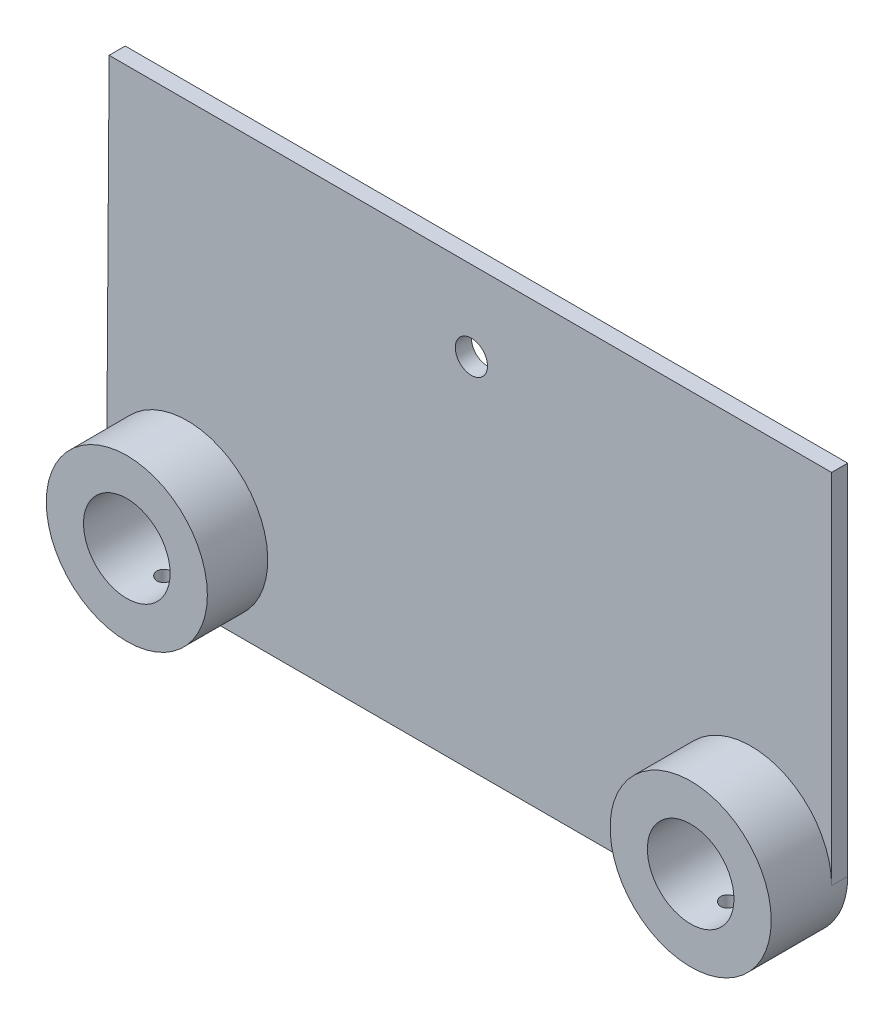
ISO-10303-21;
HEADER;
FILE_DESCRIPTION(('STEP AP214'),'2;1');
FILE_NAME('part.step','',(''),(''),'','','');
FILE_SCHEMA(('AUTOMOTIVE_DESIGN { 1 0 10303 214 1 1 1 1 }'));
ENDSEC;
DATA;
#1=APPLICATION_CONTEXT('core data for automotive mechanical design processes');
#2=APPLICATION_PROTOCOL_DEFINITION('international standard','automotive_design',2000,#1);
#3=PRODUCT_CONTEXT('',#1,'mechanical');
#4=PRODUCT('Part','Part','',(#3));
#5=PRODUCT_RELATED_PRODUCT_CATEGORY('part','',(#4));
#6=PRODUCT_DEFINITION_FORMATION('','',#4);
#7=PRODUCT_DEFINITION_CONTEXT('part definition',#1,'design');
#8=PRODUCT_DEFINITION('design','',#6,#7);
#9=PRODUCT_DEFINITION_SHAPE('','',#8);
#10=(LENGTH_UNIT() NAMED_UNIT(*) SI_UNIT(.MILLI.,.METRE.));
#11=(NAMED_UNIT(*) PLANE_ANGLE_UNIT() SI_UNIT($,.RADIAN.));
#12=(NAMED_UNIT(*) SI_UNIT($,.STERADIAN.) SOLID_ANGLE_UNIT());
#13=UNCERTAINTY_MEASURE_WITH_UNIT(LENGTH_MEASURE(1.E-05),#10,'distance_accuracy_value','');
#14=(GEOMETRIC_REPRESENTATION_CONTEXT(3) GLOBAL_UNCERTAINTY_ASSIGNED_CONTEXT((#13)) GLOBAL_UNIT_ASSIGNED_CONTEXT((#10,
#11,#12)) REPRESENTATION_CONTEXT('',''));
#15=CARTESIAN_POINT('',(0.,0.,0.));
#16=DIRECTION('',(0.,0.,1.));
#17=DIRECTION('',(1.,0.,0.));
#18=AXIS2_PLACEMENT_3D('',#15,#16,#17);
#19=CARTESIAN_POINT('',(70.,0.,4.));
#20=DIRECTION('',(0.,0.,1.));
#21=DIRECTION('',(1.,0.,0.));
#22=AXIS2_PLACEMENT_3D('',#19,#20,#21);
#23=PLANE('',#22);
#24=CARTESIAN_POINT('',(0.554740673181675,69.,4.));
#25=DIRECTION('',(0.,0.,1.));
#26=DIRECTION('',(1.,0.,0.));
#27=AXIS2_PLACEMENT_3D('',#24,#25,#26);
#28=CIRCLE('',#27,4.);
#29=CARTESIAN_POINT('',(4.55474067318168,69.,4.));
#30=VERTEX_POINT('',#29);
#31=EDGE_CURVE('E142',#30,#30,#28,.F.);
#32=ORIENTED_EDGE('',*,*,#31,.T.);
#33=EDGE_LOOP('',(#32));
#34=FACE_BOUND('',#33,.T.);
#35=DIRECTION('',(1.,0.,0.));
#36=VECTOR('',#35,1.);
#37=CARTESIAN_POINT('',(-70.,-20.,4.));
#38=LINE('',#37,#36);
#39=CARTESIAN_POINT('',(-70.,-20.,4.));
#40=VERTEX_POINT('',#39);
#41=CARTESIAN_POINT('',(70.,-20.,4.));
#42=VERTEX_POINT('',#41);
#43=EDGE_CURVE('E115',#40,#42,#38,.T.);
#44=ORIENTED_EDGE('',*,*,#43,.T.);
#45=CARTESIAN_POINT('',(70.,0.,4.));
#46=DIRECTION('',(0.,0.,1.));
#47=DIRECTION('',(1.,0.,0.));
#48=AXIS2_PLACEMENT_3D('',#45,#46,#47);
#49=CIRCLE('',#48,20.);
#50=CARTESIAN_POINT('',(90.,0.,4.));
#51=VERTEX_POINT('',#50);
#52=EDGE_CURVE('E103',#42,#51,#49,.F.);
#53=ORIENTED_EDGE('',*,*,#52,.T.);
#54=DIRECTION('',(0.,1.,0.));
#55=VECTOR('',#54,1.);
#56=CARTESIAN_POINT('',(90.,88.85,4.));
#57=LINE('',#56,#55);
#58=CARTESIAN_POINT('',(90.,88.85,4.));
#59=VERTEX_POINT('',#58);
#60=EDGE_CURVE('E64',#51,#59,#57,.T.);
#61=ORIENTED_EDGE('',*,*,#60,.T.);
#62=DIRECTION('',(-1.,0.,0.));
#63=VECTOR('',#62,1.);
#64=CARTESIAN_POINT('',(-89.3894864788953,88.85,4.));
#65=LINE('',#64,#63);
#66=CARTESIAN_POINT('',(-89.3894864788953,88.85,4.));
#67=VERTEX_POINT('',#66);
#68=EDGE_CURVE('E152',#59,#67,#65,.T.);
#69=ORIENTED_EDGE('',*,*,#68,.T.);
#70=DIRECTION('',(-0.00687112109239564,-0.999976393568835,0.));
#71=VECTOR('',#70,1.);
#72=CARTESIAN_POINT('',(-89.3894864788953,88.85,4.));
#73=LINE('',#72,#71);
#74=CARTESIAN_POINT('',(-89.9981115077974,0.274838355588614,4.));
#75=VERTEX_POINT('',#74);
#76=EDGE_CURVE('E94',#67,#75,#73,.T.);
#77=ORIENTED_EDGE('',*,*,#76,.T.);
#78=CARTESIAN_POINT('',(-70.,0.,4.));
#79=DIRECTION('',(0.,0.,1.));
#80=DIRECTION('',(1.,0.,0.));
#81=AXIS2_PLACEMENT_3D('',#78,#79,#80);
#82=CIRCLE('',#81,20.);
#83=EDGE_CURVE('E117',#75,#40,#82,.F.);
#84=ORIENTED_EDGE('',*,*,#83,.T.);
#85=EDGE_LOOP('',(#44,#53,#61,#69,#77,#84));
#86=FACE_BOUND('',#85,.T.);
#87=ADVANCED_FACE('F33',(#34,#86),#23,.T.);
#88=CARTESIAN_POINT('',(-89.3894864788953,88.85,4.));
#89=DIRECTION('',(0.999976393568835,-0.00687112109239564,0.));
#90=DIRECTION('',(0.00687112109239564,0.999976393568835,0.));
#91=AXIS2_PLACEMENT_3D('',#88,#89,#90);
#92=PLANE('',#91);
#93=DIRECTION('',(0.,0.,-1.));
#94=VECTOR('',#93,1.);
#95=CARTESIAN_POINT('',(-89.9981115077974,0.274838355588631,19.));
#96=LINE('',#95,#94);
#97=CARTESIAN_POINT('',(-89.9981115077974,0.274838355588631,0.));
#98=VERTEX_POINT('',#97);
#99=EDGE_CURVE('E55',#75,#98,#96,.T.);
#100=ORIENTED_EDGE('',*,*,#99,.F.);
#101=ORIENTED_EDGE('',*,*,#76,.F.);
#102=DIRECTION('',(0.,0.,-1.));
#103=VECTOR('',#102,1.);
#104=CARTESIAN_POINT('',(-89.3894864788953,88.85,4.));
#105=LINE('',#104,#103);
#106=CARTESIAN_POINT('',(-89.3894864788953,88.85,0.));
#107=VERTEX_POINT('',#106);
#108=EDGE_CURVE('E11',#67,#107,#105,.T.);
#109=ORIENTED_EDGE('',*,*,#108,.T.);
#110=DIRECTION('',(-0.00687112109239564,-0.999976393568835,0.));
#111=VECTOR('',#110,1.);
#112=CARTESIAN_POINT('',(-89.3894864788953,88.85,0.));
#113=LINE('',#112,#111);
#114=EDGE_CURVE('E158',#107,#98,#113,.T.);
#115=ORIENTED_EDGE('',*,*,#114,.T.);
#116=EDGE_LOOP('',(#100,#101,#109,#115));
#117=FACE_BOUND('',#116,.T.);
#118=ADVANCED_FACE('F173',(#117),#92,.F.);
#119=CARTESIAN_POINT('',(70.,0.,0.));
#120=DIRECTION('',(0.,0.,1.));
#121=DIRECTION('',(1.,0.,0.));
#122=AXIS2_PLACEMENT_3D('',#119,#120,#121);
#123=PLANE('',#122);
#124=CARTESIAN_POINT('',(70.,0.,0.));
#125=DIRECTION('',(0.,0.,1.));
#126=DIRECTION('',(1.,0.,0.));
#127=AXIS2_PLACEMENT_3D('',#124,#125,#126);
#128=CIRCLE('',#127,20.);
#129=CARTESIAN_POINT('',(70.,-20.,0.));
#130=VERTEX_POINT('',#129);
#131=CARTESIAN_POINT('',(90.,0.,0.));
#132=VERTEX_POINT('',#131);
#133=EDGE_CURVE('E160',#130,#132,#128,.T.);
#134=ORIENTED_EDGE('',*,*,#133,.F.);
#135=DIRECTION('',(1.,0.,0.));
#136=VECTOR('',#135,1.);
#137=CARTESIAN_POINT('',(-70.,-20.,0.));
#138=LINE('',#137,#136);
#139=CARTESIAN_POINT('',(-70.,-20.,0.));
#140=VERTEX_POINT('',#139);
#141=EDGE_CURVE('E124',#140,#130,#138,.T.);
#142=ORIENTED_EDGE('',*,*,#141,.F.);
#143=CARTESIAN_POINT('',(-70.,0.,0.));
#144=DIRECTION('',(0.,0.,1.));
#145=DIRECTION('',(1.,0.,0.));
#146=AXIS2_PLACEMENT_3D('',#143,#144,#145);
#147=CIRCLE('',#146,20.);
#148=CARTESIAN_POINT('',(-90.,0.,0.));
#149=VERTEX_POINT('',#148);
#150=EDGE_CURVE('E161',#149,#140,#147,.T.);
#151=ORIENTED_EDGE('',*,*,#150,.F.);
#152=CARTESIAN_POINT('',(-70.,0.,0.));
#153=DIRECTION('',(0.,0.,1.));
#154=DIRECTION('',(-0.999905575389868,0.0137419177794317,0.));
#155=AXIS2_PLACEMENT_3D('',#152,#153,#154);
#156=CIRCLE('',#155,20.);
#157=EDGE_CURVE('E171',#98,#149,#156,.T.);
#158=ORIENTED_EDGE('',*,*,#157,.F.);
#159=ORIENTED_EDGE('',*,*,#114,.F.);
#160=DIRECTION('',(-1.,0.,0.));
#161=VECTOR('',#160,1.);
#162=CARTESIAN_POINT('',(-89.3894864788953,88.85,0.));
#163=LINE('',#162,#161);
#164=CARTESIAN_POINT('',(90.,88.85,0.));
#165=VERTEX_POINT('',#164);
#166=EDGE_CURVE('E151',#165,#107,#163,.T.);
#167=ORIENTED_EDGE('',*,*,#166,.F.);
#168=DIRECTION('',(0.,1.,0.));
#169=VECTOR('',#168,1.);
#170=CARTESIAN_POINT('',(90.,88.85,0.));
#171=LINE('',#170,#169);
#172=EDGE_CURVE('E91',#132,#165,#171,.T.);
#173=ORIENTED_EDGE('',*,*,#172,.F.);
#174=EDGE_LOOP('',(#134,#142,#151,#158,#159,#167,#173));
#175=FACE_BOUND('',#174,.T.);
#176=CARTESIAN_POINT('',(70.,0.,0.));
#177=DIRECTION('',(0.,0.,1.));
#178=DIRECTION('',(1.,0.,0.));
#179=AXIS2_PLACEMENT_3D('',#176,#177,#178);
#180=CIRCLE('',#179,10.75);
#181=CARTESIAN_POINT('',(80.75,0.,0.));
#182=VERTEX_POINT('',#181);
#183=EDGE_CURVE('E148',#182,#182,#180,.T.);
#184=ORIENTED_EDGE('',*,*,#183,.T.);
#185=EDGE_LOOP('',(#184));
#186=FACE_BOUND('',#185,.T.);
#187=CARTESIAN_POINT('',(0.554740673181675,69.,0.));
#188=DIRECTION('',(0.,0.,1.));
#189=DIRECTION('',(1.,0.,0.));
#190=AXIS2_PLACEMENT_3D('',#187,#188,#189);
#191=CIRCLE('',#190,4.);
#192=CARTESIAN_POINT('',(4.55474067318168,69.,0.));
#193=VERTEX_POINT('',#192);
#194=EDGE_CURVE('E138',#193,#193,#191,.T.);
#195=ORIENTED_EDGE('',*,*,#194,.T.);
#196=EDGE_LOOP('',(#195));
#197=FACE_BOUND('',#196,.T.);
#198=CARTESIAN_POINT('',(-70.,0.,0.));
#199=DIRECTION('',(0.,0.,1.));
#200=DIRECTION('',(1.,0.,0.));
#201=AXIS2_PLACEMENT_3D('',#198,#199,#200);
#202=CIRCLE('',#201,10.75);
#203=CARTESIAN_POINT('',(-59.25,0.,0.));
#204=VERTEX_POINT('',#203);
#205=EDGE_CURVE('E145',#204,#204,#202,.T.);
#206=ORIENTED_EDGE('',*,*,#205,.T.);
#207=EDGE_LOOP('',(#206));
#208=FACE_BOUND('',#207,.T.);
#209=ADVANCED_FACE('F168',(#175,#186,#197,#208),#123,.F.);
#210=CARTESIAN_POINT('',(-89.3894864788953,88.85,4.));
#211=DIRECTION('',(0.,-1.,0.));
#212=DIRECTION('',(0.,0.,-1.));
#213=AXIS2_PLACEMENT_3D('',#210,#211,#212);
#214=PLANE('',#213);
#215=ORIENTED_EDGE('',*,*,#166,.T.);
#216=ORIENTED_EDGE('',*,*,#108,.F.);
#217=ORIENTED_EDGE('',*,*,#68,.F.);
#218=DIRECTION('',(0.,0.,-1.));
#219=VECTOR('',#218,1.);
#220=CARTESIAN_POINT('',(90.,88.85,4.));
#221=LINE('',#220,#219);
#222=EDGE_CURVE('E127',#59,#165,#221,.T.);
#223=ORIENTED_EDGE('',*,*,#222,.T.);
#224=EDGE_LOOP('',(#215,#216,#217,#223));
#225=FACE_BOUND('',#224,.T.);
#226=ADVANCED_FACE('F35',(#225),#214,.F.);
#227=CARTESIAN_POINT('',(-70.,0.,4.));
#228=DIRECTION('',(0.,0.,-1.));
#229=DIRECTION('',(-1.,0.,0.));
#230=AXIS2_PLACEMENT_3D('',#227,#228,#229);
#231=CYLINDRICAL_SURFACE('',#230,20.);
#232=CARTESIAN_POINT('',(-70.,-20.,11.5));
#233=CARTESIAN_POINT('',(-69.8879592924169,-19.9999987104154,11.4999951481992));
#234=CARTESIAN_POINT('',(-69.7758445096645,-19.9990485119241,11.4905534622071));
#235=CARTESIAN_POINT('',(-69.5547232030063,-19.9953493518948,11.4530312594191));
#236=CARTESIAN_POINT('',(-69.4457202416624,-19.9925984086805,11.4249302079508));
#237=CARTESIAN_POINT('',(-69.2340566490932,-19.9856082912614,11.3509155188043));
#238=CARTESIAN_POINT('',(-69.1313922307702,-19.9813700160142,11.305012638963));
#239=CARTESIAN_POINT('',(-68.9352476780792,-19.9718791478861,11.1967181841367));
#240=CARTESIAN_POINT('',(-68.8417657224418,-19.9666267567626,11.1343298879997));
#241=CARTESIAN_POINT('',(-68.6662808986518,-19.9556748868265,10.9945946046755));
#242=CARTESIAN_POINT('',(-68.5843157103302,-19.9499740314773,10.9172004011959));
#243=CARTESIAN_POINT('',(-68.434514957138,-19.9387791381253,10.7497509314739));
#244=CARTESIAN_POINT('',(-68.3666800458347,-19.9332851096983,10.6596950799152));
#245=CARTESIAN_POINT('',(-68.2469320591128,-19.9231118310557,10.4692429366328));
#246=CARTESIAN_POINT('',(-68.1950530690902,-19.9184343342181,10.3688251118103));
#247=CARTESIAN_POINT('',(-68.1089072305145,-19.9104407509305,10.16064882819));
#248=CARTESIAN_POINT('',(-68.0746399468174,-19.9071246308444,10.0528905508321));
#249=CARTESIAN_POINT('',(-68.0248019167962,-19.9022416814596,9.83347639826798));
#250=CARTESIAN_POINT('',(-68.0091686939924,-19.9006690079619,9.72183484629559));
#251=CARTESIAN_POINT('',(-67.9968494297293,-19.8994328612105,9.49750227320844));
#252=CARTESIAN_POINT('',(-68.0001628902584,-19.8997693377749,9.38481127975589));
#253=CARTESIAN_POINT('',(-68.0255914394946,-19.9023081379787,9.16200938061337));
#254=CARTESIAN_POINT('',(-68.0476383117509,-19.904503691813,9.05189060134262));
#255=CARTESIAN_POINT('',(-68.1098017116988,-19.9105026857484,8.83692407359782));
#256=CARTESIAN_POINT('',(-68.1499184834885,-19.9143061475698,8.73207639634994));
#257=CARTESIAN_POINT('',(-68.247158212237,-19.9231001890414,8.53041282540223));
#258=CARTESIAN_POINT('',(-68.30431143456,-19.9280928781632,8.43361162102138));
#259=CARTESIAN_POINT('',(-68.4339799452935,-19.9387010346576,8.25094957017624));
#260=CARTESIAN_POINT('',(-68.506495683327,-19.9443165202557,8.16508904403648));
#261=CARTESIAN_POINT('',(-68.6652117751759,-19.9555677062598,8.00634921202195));
#262=CARTESIAN_POINT('',(-68.7514710422973,-19.96120338666,7.9335287962384));
#263=CARTESIAN_POINT('',(-68.9350210365258,-19.9718365815704,7.80339273417923));
#264=CARTESIAN_POINT('',(-69.0323117760008,-19.9768340953651,7.74607710528705));
#265=CARTESIAN_POINT('',(-69.2352037886153,-19.9856295133419,7.6485799593795));
#266=CARTESIAN_POINT('',(-69.3408065072202,-19.9894272082954,7.60840143036388));
#267=CARTESIAN_POINT('',(-69.5573055653401,-19.9953929488282,7.5463621665765));
#268=CARTESIAN_POINT('',(-69.6682017464468,-19.9975610431413,7.52450088401876));
#269=CARTESIAN_POINT('',(-69.8916298018162,-20.0000170333662,7.49979138453047));
#270=CARTESIAN_POINT('',(-70.004152604211,-20.0003129653547,7.49686190349501));
#271=CARTESIAN_POINT('',(-70.2280875866314,-19.9990128351359,7.50988572609753));
#272=CARTESIAN_POINT('',(-70.3394997816409,-19.9974167984894,7.52583877463056));
#273=CARTESIAN_POINT('',(-70.5578164136693,-19.9925172307839,7.57610739084315));
#274=CARTESIAN_POINT('',(-70.664729697944,-19.9892172383608,7.61038490895602));
#275=CARTESIAN_POINT('',(-70.8712886427676,-19.9812799772122,7.69629034807454));
#276=CARTESIAN_POINT('',(-70.9709341403142,-19.9766426785051,7.74791865807879));
#277=CARTESIAN_POINT('',(-71.1604963603443,-19.9665295066084,7.86726167732782));
#278=CARTESIAN_POINT('',(-71.2503793194978,-19.9610508720688,7.93502977785163));
#279=CARTESIAN_POINT('',(-71.4175232466237,-19.9498786573904,8.08465213548185));
#280=CARTESIAN_POINT('',(-71.4947838976984,-19.9441850718594,8.16650674614064));
#281=CARTESIAN_POINT('',(-71.6347722197743,-19.9332004828151,8.34233314931801));
#282=CARTESIAN_POINT('',(-71.6974465573591,-19.9279110027795,8.43634751308525));
#283=CARTESIAN_POINT('',(-71.8061165174877,-19.9183566492178,8.63361472029337));
#284=CARTESIAN_POINT('',(-71.8521123681078,-19.9140917616808,8.73686743737678));
#285=CARTESIAN_POINT('',(-71.9260304173689,-19.907078952681,8.94949747893158));
#286=CARTESIAN_POINT('',(-71.9539843496237,-19.9043283689958,9.05886368018223));
#287=CARTESIAN_POINT('',(-71.9911280142589,-19.9006473056575,9.28076639592154));
#288=CARTESIAN_POINT('',(-72.000318284799,-19.8997167738037,9.39330281939134));
#289=CARTESIAN_POINT('',(-71.9996662769425,-19.8997822621512,9.61782137671341));
#290=CARTESIAN_POINT('',(-71.9899077791862,-19.9007698017402,9.72980376576563));
#291=CARTESIAN_POINT('',(-71.9518109059273,-19.9045420777909,9.95052983433657));
#292=CARTESIAN_POINT('',(-71.9234725095243,-19.9073268162744,10.059273510212));
#293=CARTESIAN_POINT('',(-71.849043372595,-19.9143773652637,10.2704346980957));
#294=CARTESIAN_POINT('',(-71.8029550886818,-19.9186429708072,10.3728530832594));
#295=CARTESIAN_POINT('',(-71.6943431098221,-19.9281750367872,10.5685137833421));
#296=CARTESIAN_POINT('',(-71.6318195069108,-19.933441491619,10.6617561496413));
#297=CARTESIAN_POINT('',(-71.4917971125707,-19.944409744194,10.8368473489439));
#298=CARTESIAN_POINT('',(-71.4142358977805,-19.950113294535,10.9186461527342));
#299=CARTESIAN_POINT('',(-71.2464633984502,-19.9612970945757,11.0681044653993));
#300=CARTESIAN_POINT('',(-71.1562490882165,-19.9667772904595,11.1357605827143));
#301=CARTESIAN_POINT('',(-70.9654828683226,-19.9769112413832,11.2551469077092));
#302=CARTESIAN_POINT('',(-70.8649054986935,-19.9815628805362,11.3068365818904));
#303=CARTESIAN_POINT('',(-70.6565165582011,-19.9894925849979,11.3925248456477));
#304=CARTESIAN_POINT('',(-70.5487132996512,-19.9927721981931,11.4265433819071));
#305=CARTESIAN_POINT('',(-70.3669165228114,-19.9967642754747,11.4674412341696));
#306=CARTESIAN_POINT('',(-70.294085105689,-19.9979720138367,11.4796340885987));
#307=CARTESIAN_POINT('',(-70.1475131616346,-19.9995902990157,11.4959150521235));
#308=CARTESIAN_POINT('',(-70.0737726384531,-20.0000008491205,11.5000031946437));
#309=CARTESIAN_POINT('',(-70.,-20.,11.5));
#310=B_SPLINE_CURVE_WITH_KNOTS('',3,(#232,#233,#234,#235,#236,#237,#238,#239,#240,#241,#242,
#243,#244,#245,#246,#247,#248,#249,#250,#251,#252,#253,#254,#255,#256,#257,#258,#259,#260,#261,
#262,#263,#264,#265,#266,#267,#268,#269,#270,#271,#272,#273,#274,#275,#276,#277,#278,#279,#280,
#281,#282,#283,#284,#285,#286,#287,#288,#289,#290,#291,#292,#293,#294,#295,#296,#297,#298,#299,
#300,#301,#302,#303,#304,#305,#306,#307,#308,#309),.UNSPECIFIED.,.T.,.F.,(4,2,2,2,2,2,2,2,2,2,2,
2,2,2,2,2,2,2,2,2,2,2,2,2,2,2,2,2,2,2,2,2,2,2,2,2,2,2,4),(0.,0.335852732536947,
0.672075685670967,1.00809577146442,1.34404907516556,1.68107713724587,2.0181207844141,
2.35587950944442,2.69362988885007,3.03024464090392,3.36685054511552,3.70223594882219,
4.03762588323266,4.37361522745788,4.70961440662249,5.04709468392412,5.38457533959542,
5.72211481387162,6.05964419350877,6.39572377215513,6.73179881038284,7.06717870588608,
7.40256612098931,7.73907881497394,8.07559995620459,8.41333287217195,8.75106116950745,
9.08819381186004,9.42531678479168,9.7609525858791,10.0965887645208,10.432178507256,
10.7677663707792,11.104778348553,11.4418710527391,11.7798126205248,12.1173718959059,
12.338513344647,12.5596538813805),.UNSPECIFIED.);
#311=CARTESIAN_POINT('',(-70.,-20.,11.5));
#312=VERTEX_POINT('',#311);
#313=EDGE_CURVE('E195',#312,#312,#310,.T.);
#314=ORIENTED_EDGE('',*,*,#313,.T.);
#315=EDGE_LOOP('',(#314));
#316=FACE_BOUND('',#315,.T.);
#317=DIRECTION('',(0.,0.,-1.));
#318=VECTOR('',#317,1.);
#319=CARTESIAN_POINT('',(-70.,-20.,4.));
#320=LINE('',#319,#318);
#321=EDGE_CURVE('E47',#40,#140,#320,.T.);
#322=ORIENTED_EDGE('',*,*,#321,.F.);
#323=ORIENTED_EDGE('',*,*,#83,.F.);
#324=ORIENTED_EDGE('',*,*,#99,.T.);
#325=ORIENTED_EDGE('',*,*,#157,.T.);
#326=ORIENTED_EDGE('',*,*,#150,.T.);
#327=EDGE_LOOP('',(#322,#323,#324,#325,#326));
#328=FACE_BOUND('',#327,.T.);
#329=CARTESIAN_POINT('',(-70.,0.,19.));
#330=DIRECTION('',(0.,0.,1.));
#331=DIRECTION('',(1.,0.,0.));
#332=AXIS2_PLACEMENT_3D('',#329,#330,#331);
#333=CIRCLE('',#332,20.);
#334=CARTESIAN_POINT('',(-50.,0.,19.));
#335=VERTEX_POINT('',#334);
#336=EDGE_CURVE('E250',#335,#335,#333,.T.);
#337=ORIENTED_EDGE('',*,*,#336,.F.);
#338=EDGE_LOOP('',(#337));
#339=FACE_BOUND('',#338,.T.);
#340=ADVANCED_FACE('F183',(#316,#328,#339),#231,.T.);
#341=CARTESIAN_POINT('',(-70.,-20.,4.));
#342=DIRECTION('',(0.,1.,0.));
#343=DIRECTION('',(0.,0.,1.));
#344=AXIS2_PLACEMENT_3D('',#341,#342,#343);
#345=PLANE('',#344);
#346=ORIENTED_EDGE('',*,*,#141,.T.);
#347=DIRECTION('',(0.,0.,-1.));
#348=VECTOR('',#347,1.);
#349=CARTESIAN_POINT('',(70.,-20.,4.));
#350=LINE('',#349,#348);
#351=EDGE_CURVE('E108',#42,#130,#350,.T.);
#352=ORIENTED_EDGE('',*,*,#351,.F.);
#353=ORIENTED_EDGE('',*,*,#43,.F.);
#354=ORIENTED_EDGE('',*,*,#321,.T.);
#355=EDGE_LOOP('',(#346,#352,#353,#354));
#356=FACE_BOUND('',#355,.T.);
#357=ADVANCED_FACE('F122',(#356),#345,.F.);
#358=CARTESIAN_POINT('',(70.,0.,4.));
#359=DIRECTION('',(0.,0.,-1.));
#360=DIRECTION('',(-1.,0.,0.));
#361=AXIS2_PLACEMENT_3D('',#358,#359,#360);
#362=CYLINDRICAL_SURFACE('',#361,20.);
#363=CARTESIAN_POINT('',(70.,-20.,11.5));
#364=CARTESIAN_POINT('',(70.1120407075831,-19.9999987104154,11.4999951481992));
#365=CARTESIAN_POINT('',(70.2241554903355,-19.9990485119241,11.4905534622071));
#366=CARTESIAN_POINT('',(70.4452767969937,-19.9953493518948,11.4530312594191));
#367=CARTESIAN_POINT('',(70.5542797583377,-19.9925984086805,11.4249302079508));
#368=CARTESIAN_POINT('',(70.7659433509068,-19.9856082912614,11.3509155188043));
#369=CARTESIAN_POINT('',(70.8686077692298,-19.9813700160142,11.3050126389631));
#370=CARTESIAN_POINT('',(71.0647523219208,-19.9718791478861,11.1967181841367));
#371=CARTESIAN_POINT('',(71.1582342775582,-19.9666267567626,11.1343298879997));
#372=CARTESIAN_POINT('',(71.3337191013482,-19.9556748868265,10.9945946046755));
#373=CARTESIAN_POINT('',(71.4156842896698,-19.9499740314773,10.9172004011959));
#374=CARTESIAN_POINT('',(71.565485042862,-19.9387791381252,10.7497509314739));
#375=CARTESIAN_POINT('',(71.6333199541653,-19.9332851096983,10.6596950799152));
#376=CARTESIAN_POINT('',(71.7530679408872,-19.9231118310557,10.4692429366328));
#377=CARTESIAN_POINT('',(71.8049469309098,-19.9184343342181,10.3688251118103));
#378=CARTESIAN_POINT('',(71.8910927694855,-19.9104407509305,10.16064882819));
#379=CARTESIAN_POINT('',(71.9253600531826,-19.9071246308444,10.0528905508321));
#380=CARTESIAN_POINT('',(71.9751980832038,-19.9022416814596,9.83347639826798));
#381=CARTESIAN_POINT('',(71.9908313060076,-19.9006690079619,9.72183484629559));
#382=CARTESIAN_POINT('',(72.0031505702707,-19.8994328612105,9.49750227320845));
#383=CARTESIAN_POINT('',(71.9998371097416,-19.8997693377749,9.38481127975589));
#384=CARTESIAN_POINT('',(71.9744085605054,-19.9023081379787,9.16200938061337));
#385=CARTESIAN_POINT('',(71.9523616882491,-19.904503691813,9.05189060134262));
#386=CARTESIAN_POINT('',(71.8901982883012,-19.9105026857484,8.83692407359782));
#387=CARTESIAN_POINT('',(71.8500815165115,-19.9143061475698,8.73207639634995));
#388=CARTESIAN_POINT('',(71.752841787763,-19.9231001890414,8.53041282540223));
#389=CARTESIAN_POINT('',(71.69568856544,-19.9280928781632,8.43361162102138));
#390=CARTESIAN_POINT('',(71.5660200547065,-19.9387010346576,8.25094957017624));
#391=CARTESIAN_POINT('',(71.493504316673,-19.9443165202557,8.16508904403648));
#392=CARTESIAN_POINT('',(71.3347882248241,-19.9555677062598,8.00634921202196));
#393=CARTESIAN_POINT('',(71.2485289577027,-19.96120338666,7.9335287962384));
#394=CARTESIAN_POINT('',(71.0649789634742,-19.9718365815704,7.80339273417923));
#395=CARTESIAN_POINT('',(70.9676882239992,-19.9768340953651,7.74607710528705));
#396=CARTESIAN_POINT('',(70.7647962113847,-19.9856295133419,7.6485799593795));
#397=CARTESIAN_POINT('',(70.6591934927798,-19.9894272082954,7.60840143036388));
#398=CARTESIAN_POINT('',(70.4426944346599,-19.9953929488282,7.5463621665765));
#399=CARTESIAN_POINT('',(70.3317982535532,-19.9975610431413,7.52450088401876));
#400=CARTESIAN_POINT('',(70.1083701981838,-20.0000170333662,7.49979138453048));
#401=CARTESIAN_POINT('',(69.995847395789,-20.0003129653547,7.49686190349501));
#402=CARTESIAN_POINT('',(69.7719124133686,-19.9990128351359,7.50988572609753));
#403=CARTESIAN_POINT('',(69.6605002183591,-19.9974167984894,7.52583877463056));
#404=CARTESIAN_POINT('',(69.4421835863307,-19.9925172307839,7.57610739084315));
#405=CARTESIAN_POINT('',(69.335270302056,-19.9892172383608,7.61038490895602));
#406=CARTESIAN_POINT('',(69.1287113572325,-19.9812799772122,7.69629034807454));
#407=CARTESIAN_POINT('',(69.0290658596858,-19.9766426785051,7.74791865807879));
#408=CARTESIAN_POINT('',(68.8395036396557,-19.9665295066084,7.86726167732782));
#409=CARTESIAN_POINT('',(68.7496206805022,-19.9610508720688,7.93502977785163));
#410=CARTESIAN_POINT('',(68.5824767533763,-19.9498786573904,8.08465213548186));
#411=CARTESIAN_POINT('',(68.5052161023017,-19.9441850718594,8.16650674614064));
#412=CARTESIAN_POINT('',(68.3652277802257,-19.9332004828151,8.34233314931801));
#413=CARTESIAN_POINT('',(68.3025534426409,-19.9279110027795,8.43634751308525));
#414=CARTESIAN_POINT('',(68.1938834825124,-19.9183566492178,8.63361472029337));
#415=CARTESIAN_POINT('',(68.1478876318922,-19.9140917616808,8.73686743737678));
#416=CARTESIAN_POINT('',(68.0739695826311,-19.907078952681,8.94949747893158));
#417=CARTESIAN_POINT('',(68.0460156503763,-19.9043283689958,9.05886368018223));
#418=CARTESIAN_POINT('',(68.0088719857411,-19.9006473056575,9.28076639592154));
#419=CARTESIAN_POINT('',(67.999681715201,-19.8997167738037,9.39330281939135));
#420=CARTESIAN_POINT('',(68.0003337230575,-19.8997822621512,9.61782137671341));
#421=CARTESIAN_POINT('',(68.0100922208138,-19.9007698017402,9.72980376576563));
#422=CARTESIAN_POINT('',(68.0481890940727,-19.9045420777909,9.95052983433657));
#423=CARTESIAN_POINT('',(68.0765274904757,-19.9073268162744,10.059273510212));
#424=CARTESIAN_POINT('',(68.150956627405,-19.9143773652637,10.2704346980957));
#425=CARTESIAN_POINT('',(68.1970449113182,-19.9186429708072,10.3728530832594));
#426=CARTESIAN_POINT('',(68.3056568901779,-19.9281750367872,10.5685137833421));
#427=CARTESIAN_POINT('',(68.3681804930892,-19.933441491619,10.6617561496413));
#428=CARTESIAN_POINT('',(68.5082028874293,-19.944409744194,10.8368473489439));
#429=CARTESIAN_POINT('',(68.5857641022195,-19.950113294535,10.9186461527342));
#430=CARTESIAN_POINT('',(68.7535366015498,-19.9612970945757,11.0681044653993));
#431=CARTESIAN_POINT('',(68.8437509117835,-19.9667772904595,11.1357605827143));
#432=CARTESIAN_POINT('',(69.0345171316774,-19.9769112413832,11.2551469077092));
#433=CARTESIAN_POINT('',(69.1350945013065,-19.9815628805362,11.3068365818904));
#434=CARTESIAN_POINT('',(69.3434834417989,-19.9894925849979,11.3925248456477));
#435=CARTESIAN_POINT('',(69.4512867003488,-19.9927721981931,11.4265433819071));
#436=CARTESIAN_POINT('',(69.6330834771886,-19.9967642754747,11.4674412341696));
#437=CARTESIAN_POINT('',(69.705914894311,-19.9979720138367,11.4796340885987));
#438=CARTESIAN_POINT('',(69.8524868383654,-19.9995902990157,11.4959150521235));
#439=CARTESIAN_POINT('',(69.9262273615469,-20.0000008491205,11.5000031946437));
#440=CARTESIAN_POINT('',(70.,-20.,11.5));
#441=B_SPLINE_CURVE_WITH_KNOTS('',3,(#363,#364,#365,#366,#367,#368,#369,#370,#371,#372,#373,
#374,#375,#376,#377,#378,#379,#380,#381,#382,#383,#384,#385,#386,#387,#388,#389,#390,#391,#392,
#393,#394,#395,#396,#397,#398,#399,#400,#401,#402,#403,#404,#405,#406,#407,#408,#409,#410,#411,
#412,#413,#414,#415,#416,#417,#418,#419,#420,#421,#422,#423,#424,#425,#426,#427,#428,#429,#430,
#431,#432,#433,#434,#435,#436,#437,#438,#439,#440),.UNSPECIFIED.,.T.,.F.,(4,2,2,2,2,2,2,2,2,2,2,
2,2,2,2,2,2,2,2,2,2,2,2,2,2,2,2,2,2,2,2,2,2,2,2,2,2,2,4),(0.,0.335852732536947,
0.672075685670967,1.00809577146438,1.34404907516556,1.68107713724588,2.0181207844141,
2.35587950944442,2.69362988885007,3.03024464090392,3.36685054511552,3.70223594882219,
4.03762588323266,4.37361522745788,4.70961440662249,5.04709468392412,5.38457533959542,
5.72211481387162,6.05964419350877,6.39572377215513,6.73179881038284,7.06717870588607,
7.40256612098931,7.73907881497394,8.07559995620459,8.41333287217195,8.75106116950745,
9.08819381186003,9.42531678479168,9.7609525858791,10.0965887645208,10.432178507256,
10.7677663707792,11.104778348553,11.4418710527391,11.7798126205248,12.1173718959059,
12.3385133446469,12.5596538813805),.UNSPECIFIED.);
#442=CARTESIAN_POINT('',(70.,-20.,11.5));
#443=VERTEX_POINT('',#442);
#444=EDGE_CURVE('E203',#443,#443,#441,.T.);
#445=ORIENTED_EDGE('',*,*,#444,.T.);
#446=EDGE_LOOP('',(#445));
#447=FACE_BOUND('',#446,.T.);
#448=ORIENTED_EDGE('',*,*,#133,.T.);
#449=DIRECTION('',(0.,0.,-1.));
#450=VECTOR('',#449,1.);
#451=CARTESIAN_POINT('',(90.,0.,4.));
#452=LINE('',#451,#450);
#453=EDGE_CURVE('E110',#51,#132,#452,.T.);
#454=ORIENTED_EDGE('',*,*,#453,.F.);
#455=ORIENTED_EDGE('',*,*,#52,.F.);
#456=ORIENTED_EDGE('',*,*,#351,.T.);
#457=EDGE_LOOP('',(#448,#454,#455,#456));
#458=FACE_BOUND('',#457,.T.);
#459=CARTESIAN_POINT('',(70.,0.,19.));
#460=DIRECTION('',(0.,0.,1.));
#461=DIRECTION('',(1.,0.,0.));
#462=AXIS2_PLACEMENT_3D('',#459,#460,#461);
#463=CIRCLE('',#462,20.);
#464=CARTESIAN_POINT('',(90.,0.,19.));
#465=VERTEX_POINT('',#464);
#466=EDGE_CURVE('E112',#465,#465,#463,.T.);
#467=ORIENTED_EDGE('',*,*,#466,.F.);
#468=EDGE_LOOP('',(#467));
#469=FACE_BOUND('',#468,.T.);
#470=ADVANCED_FACE('F105',(#447,#458,#469),#362,.T.);
#471=CARTESIAN_POINT('',(90.,88.85,4.));
#472=DIRECTION('',(-1.,0.,0.));
#473=DIRECTION('',(0.,0.,1.));
#474=AXIS2_PLACEMENT_3D('',#471,#472,#473);
#475=PLANE('',#474);
#476=ORIENTED_EDGE('',*,*,#172,.T.);
#477=ORIENTED_EDGE('',*,*,#222,.F.);
#478=ORIENTED_EDGE('',*,*,#60,.F.);
#479=ORIENTED_EDGE('',*,*,#453,.T.);
#480=EDGE_LOOP('',(#476,#477,#478,#479));
#481=FACE_BOUND('',#480,.T.);
#482=ADVANCED_FACE('F232',(#481),#475,.F.);
#483=CARTESIAN_POINT('',(70.,0.,4.));
#484=DIRECTION('',(0.,0.,-1.));
#485=DIRECTION('',(-1.,0.,0.));
#486=AXIS2_PLACEMENT_3D('',#483,#484,#485);
#487=CYLINDRICAL_SURFACE('',#486,10.75);
#488=CARTESIAN_POINT('',(70.,-10.75,11.5));
#489=CARTESIAN_POINT('',(70.1113115937934,-10.7499979898458,11.4999957298792));
#490=CARTESIAN_POINT('',(70.2226789279886,-10.7482532629214,11.4906758957043));
#491=CARTESIAN_POINT('',(70.4422764109782,-10.7414613570524,11.4536661819114));
#492=CARTESIAN_POINT('',(70.5505038130731,-10.7364113726521,11.4259606965352));
#493=CARTESIAN_POINT('',(70.7606137228777,-10.7235739677097,11.3530564801438));
#494=CARTESIAN_POINT('',(70.8625018265026,-10.7157890029717,11.3078734389776));
#495=CARTESIAN_POINT('',(71.0572414279596,-10.6983321752382,11.2013409797305));
#496=CARTESIAN_POINT('',(71.1500936783232,-10.6886604695776,11.1399929094997));
#497=CARTESIAN_POINT('',(71.3252310460314,-10.6683704245625,11.0021033437944));
#498=CARTESIAN_POINT('',(71.4073941269017,-10.6577431617574,10.9254081434464));
#499=CARTESIAN_POINT('',(71.5577652263078,-10.6368061412874,10.7593320693555));
#500=CARTESIAN_POINT('',(71.6259722517391,-10.626496406262,10.6699502936096));
#501=CARTESIAN_POINT('',(71.7470013263767,-10.6072750364208,10.4801776028276));
#502=CARTESIAN_POINT('',(71.7996994872645,-10.5983749089917,10.3797064089627));
#503=CARTESIAN_POINT('',(71.887421904354,-10.5831060557579,10.1711436301924));
#504=CARTESIAN_POINT('',(71.9224476601107,-10.5767371151844,10.0630526927317));
#505=CARTESIAN_POINT('',(71.973439875545,-10.5673414942507,9.84362364439491));
#506=CARTESIAN_POINT('',(71.9896190086636,-10.5642775486884,9.73233658297204));
#507=CARTESIAN_POINT('',(72.0031187857504,-10.5617264498057,9.50858852041987));
#508=CARTESIAN_POINT('',(72.0004410944537,-10.5622389807437,9.39612762379539));
#509=CARTESIAN_POINT('',(71.9764757403291,-10.5667489902013,9.17476337003921));
#510=CARTESIAN_POINT('',(71.9554296963026,-10.5707012207446,9.06583279686444));
#511=CARTESIAN_POINT('',(71.895705472332,-10.5815742581251,8.85307612785987));
#512=CARTESIAN_POINT('',(71.8570265536386,-10.5884951893386,8.74925024609882));
#513=CARTESIAN_POINT('',(71.7628976051904,-10.6045732299577,8.54894203213757));
#514=CARTESIAN_POINT('',(71.7073498103587,-10.6137433132819,8.45250672612124));
#515=CARTESIAN_POINT('',(71.5811290696664,-10.6332778111083,8.27023469037431));
#516=CARTESIAN_POINT('',(71.5104546117091,-10.6436423449628,8.18439902156196));
#517=CARTESIAN_POINT('',(71.3546830213928,-10.6645952021616,8.02436661849693));
#518=CARTESIAN_POINT('',(71.2693791769815,-10.6751845030451,7.95037107360265));
#519=CARTESIAN_POINT('',(71.0874625178478,-10.6952459378521,7.81771042100191));
#520=CARTESIAN_POINT('',(70.99084959305,-10.7047180608997,7.7590454625318));
#521=CARTESIAN_POINT('',(70.7888489137381,-10.7214965653293,7.65868245967963));
#522=CARTESIAN_POINT('',(70.6834506443929,-10.7288003023682,7.61700510875821));
#523=CARTESIAN_POINT('',(70.4669831189086,-10.7403986151714,7.55200257111017));
#524=CARTESIAN_POINT('',(70.3559144570404,-10.7446935055784,7.52867546542098));
#525=CARTESIAN_POINT('',(70.1329901135943,-10.7497470548969,7.50131508847893));
#526=CARTESIAN_POINT('',(70.021169377672,-10.7505562406137,7.49700611832965));
#527=CARTESIAN_POINT('',(69.7984051084266,-10.7486866910348,7.50706512429287));
#528=CARTESIAN_POINT('',(69.6874615329584,-10.746008124353,7.52143219752004));
#529=CARTESIAN_POINT('',(69.4704736644529,-10.7374954871991,7.56820623777382));
#530=CARTESIAN_POINT('',(69.3643983081105,-10.7316857895141,7.60047392223407));
#531=CARTESIAN_POINT('',(69.1591630823651,-10.7175596292842,7.68198266408516));
#532=CARTESIAN_POINT('',(69.0600036773555,-10.7092429986024,7.7312248599665));
#533=CARTESIAN_POINT('',(68.8702369724876,-10.690899466265,7.84589657796905));
#534=CARTESIAN_POINT('',(68.7797333598225,-10.6808550983115,7.91149483797731));
#535=CARTESIAN_POINT('',(68.6109197978562,-10.6602158463005,8.05678798245869));
#536=CARTESIAN_POINT('',(68.5326109696034,-10.6496209117495,8.13648416149583));
#537=CARTESIAN_POINT('',(68.389364141648,-10.6289073271526,8.30895817564184));
#538=CARTESIAN_POINT('',(68.3246141564026,-10.6187967061924,8.40189328874259));
#539=CARTESIAN_POINT('',(68.2116442713422,-10.6003572432835,8.5974832282525));
#540=CARTESIAN_POINT('',(68.1634237631093,-10.5920283357576,8.70013769673352));
#541=CARTESIAN_POINT('',(68.0851492731371,-10.5781581458696,8.91177151124484));
#542=CARTESIAN_POINT('',(68.0550085766964,-10.5726035790055,9.02071787390127));
#543=CARTESIAN_POINT('',(68.0134814409468,-10.5648804078248,9.24224124574429));
#544=CARTESIAN_POINT('',(68.002092922128,-10.5627114280671,9.35481785094575));
#545=CARTESIAN_POINT('',(67.9984621612657,-10.5620238464973,9.57852322734322));
#546=CARTESIAN_POINT('',(68.0059233951408,-10.5634487096283,9.68964712056154));
#547=CARTESIAN_POINT('',(68.0391317376471,-10.5696630140558,9.90902732963684));
#548=CARTESIAN_POINT('',(68.0648787410228,-10.5744524359854,10.0172836619962));
#549=CARTESIAN_POINT('',(68.1338034740689,-10.5868325708344,10.2276995232219));
#550=CARTESIAN_POINT('',(68.1769495741334,-10.5944181984275,10.3298697312252));
#551=CARTESIAN_POINT('',(68.2794154659628,-10.6115397210939,10.5255685650477));
#552=CARTESIAN_POINT('',(68.3387363759328,-10.6210757509919,10.6190965928125));
#553=CARTESIAN_POINT('',(68.4729008912471,-10.6411993787578,10.7963424411984));
#554=CARTESIAN_POINT('',(68.5479604754388,-10.6518004083814,10.8798952814271));
#555=CARTESIAN_POINT('',(68.7110208987689,-10.6727585996435,11.0333189045481));
#556=CARTESIAN_POINT('',(68.7990247072618,-10.6831157046926,11.1031865395103));
#557=CARTESIAN_POINT('',(68.9864074241326,-10.7025264342028,11.2278328505722));
#558=CARTESIAN_POINT('',(69.0858800456567,-10.7115677213292,11.2824726232791));
#559=CARTESIAN_POINT('',(69.2927288754121,-10.7272076880381,11.3741776204373));
#560=CARTESIAN_POINT('',(69.4000975157856,-10.7338086708492,11.411259425929));
#561=CARTESIAN_POINT('',(69.5898246154037,-10.7424715014638,11.4592283011132));
#562=CARTESIAN_POINT('',(69.6710708808364,-10.745278807836,11.4744916803022));
#563=CARTESIAN_POINT('',(69.8348678924461,-10.7490437798718,11.4948789882389));
#564=CARTESIAN_POINT('',(69.9174186062812,-10.7500014913211,11.5000031679766));
#565=CARTESIAN_POINT('',(70.,-10.75,11.5));
#566=B_SPLINE_CURVE_WITH_KNOTS('',3,(#488,#489,#490,#491,#492,#493,#494,#495,#496,#497,#498,
#499,#500,#501,#502,#503,#504,#505,#506,#507,#508,#509,#510,#511,#512,#513,#514,#515,#516,#517,
#518,#519,#520,#521,#522,#523,#524,#525,#526,#527,#528,#529,#530,#531,#532,#533,#534,#535,#536,
#537,#538,#539,#540,#541,#542,#543,#544,#545,#546,#547,#548,#549,#550,#551,#552,#553,#554,#555,
#556,#557,#558,#559,#560,#561,#562,#563,#564,#565),.UNSPECIFIED.,.T.,.F.,(4,2,2,2,2,2,2,2,2,2,2,
2,2,2,2,2,2,2,2,2,2,2,2,2,2,2,2,2,2,2,2,2,2,2,2,2,2,2,4),(0.,0.333632786805715,
0.667549124274138,1.00116639340959,1.33475585412829,1.67187050268571,2.00900913178153,
2.3487720265472,2.68850608659446,3.02436811950801,3.3602005019206,3.69168078753445,
4.02317496216752,4.35662824282036,4.69011487182469,5.02877436453896,5.36743715382765,
5.70651126118905,6.04554990542493,6.37965713991974,6.71374822274426,7.04527552096233,
7.37682505923944,7.71194784376341,8.04710141746384,8.38663285340672,8.7261517905143,
9.06402902298355,9.40186878426489,9.73442721190289,10.0669837253029,10.3989383941257,
10.730916017629,11.0677885056382,11.4047383917491,11.7446680944371,12.0842761377134,
12.3318023983814,12.5793225316018),.UNSPECIFIED.);
#567=CARTESIAN_POINT('',(70.,-10.75,11.5));
#568=VERTEX_POINT('',#567);
#569=EDGE_CURVE('E37',#568,#568,#566,.T.);
#570=ORIENTED_EDGE('',*,*,#569,.F.);
#571=EDGE_LOOP('',(#570));
#572=FACE_BOUND('',#571,.T.);
#573=ORIENTED_EDGE('',*,*,#183,.F.);
#574=EDGE_LOOP('',(#573));
#575=FACE_BOUND('',#574,.T.);
#576=CARTESIAN_POINT('',(70.,0.,19.));
#577=DIRECTION('',(0.,0.,1.));
#578=DIRECTION('',(1.,0.,0.));
#579=AXIS2_PLACEMENT_3D('',#576,#577,#578);
#580=CIRCLE('',#579,10.75);
#581=CARTESIAN_POINT('',(80.75,0.,19.));
#582=VERTEX_POINT('',#581);
#583=EDGE_CURVE('E258',#582,#582,#580,.T.);
#584=ORIENTED_EDGE('',*,*,#583,.T.);
#585=EDGE_LOOP('',(#584));
#586=FACE_BOUND('',#585,.T.);
#587=ADVANCED_FACE('F227',(#572,#575,#586),#487,.F.);
#588=CARTESIAN_POINT('',(-70.,0.,4.));
#589=DIRECTION('',(0.,0.,-1.));
#590=DIRECTION('',(-1.,0.,0.));
#591=AXIS2_PLACEMENT_3D('',#588,#589,#590);
#592=CYLINDRICAL_SURFACE('',#591,10.75);
#593=CARTESIAN_POINT('',(-70.,-10.75,11.5));
#594=CARTESIAN_POINT('',(-69.8886884062066,-10.7499979898458,11.4999957298792));
#595=CARTESIAN_POINT('',(-69.7773210720114,-10.7482532629214,11.4906758957043));
#596=CARTESIAN_POINT('',(-69.5577235890218,-10.7414613570524,11.4536661819114));
#597=CARTESIAN_POINT('',(-69.449496186927,-10.7364113726521,11.4259606965352));
#598=CARTESIAN_POINT('',(-69.2393862771223,-10.7235739677097,11.3530564801438));
#599=CARTESIAN_POINT('',(-69.1374981734974,-10.7157890029717,11.3078734389776));
#600=CARTESIAN_POINT('',(-68.9427585720404,-10.6983321752382,11.2013409797305));
#601=CARTESIAN_POINT('',(-68.8499063216768,-10.6886604695776,11.1399929094997));
#602=CARTESIAN_POINT('',(-68.6747689539686,-10.6683704245625,11.0021033437944));
#603=CARTESIAN_POINT('',(-68.5926058730984,-10.6577431617574,10.9254081434464));
#604=CARTESIAN_POINT('',(-68.4422347736922,-10.6368061412874,10.7593320693555));
#605=CARTESIAN_POINT('',(-68.3740277482609,-10.626496406262,10.6699502936096));
#606=CARTESIAN_POINT('',(-68.2529986736233,-10.6072750364208,10.4801776028276));
#607=CARTESIAN_POINT('',(-68.2003005127356,-10.5983749089917,10.3797064089627));
#608=CARTESIAN_POINT('',(-68.112578095646,-10.5831060557579,10.1711436301924));
#609=CARTESIAN_POINT('',(-68.0775523398893,-10.5767371151844,10.0630526927317));
#610=CARTESIAN_POINT('',(-68.026560124455,-10.5673414942507,9.84362364439491));
#611=CARTESIAN_POINT('',(-68.0103809913364,-10.5642775486884,9.73233658297204));
#612=CARTESIAN_POINT('',(-67.9968812142496,-10.5617264498057,9.50858852041987));
#613=CARTESIAN_POINT('',(-67.9995589055464,-10.5622389807437,9.39612762379539));
#614=CARTESIAN_POINT('',(-68.0235242596709,-10.5667489902013,9.17476337003921));
#615=CARTESIAN_POINT('',(-68.0445703036974,-10.5707012207446,9.06583279686444));
#616=CARTESIAN_POINT('',(-68.104294527668,-10.5815742581251,8.85307612785987));
#617=CARTESIAN_POINT('',(-68.1429734463614,-10.5884951893386,8.74925024609882));
#618=CARTESIAN_POINT('',(-68.2371023948096,-10.6045732299577,8.54894203213756));
#619=CARTESIAN_POINT('',(-68.2926501896413,-10.6137433132819,8.45250672612124));
#620=CARTESIAN_POINT('',(-68.4188709303336,-10.6332778111083,8.27023469037431));
#621=CARTESIAN_POINT('',(-68.4895453882909,-10.6436423449628,8.18439902156196));
#622=CARTESIAN_POINT('',(-68.6453169786072,-10.6645952021616,8.02436661849693));
#623=CARTESIAN_POINT('',(-68.7306208230186,-10.6751845030451,7.95037107360265));
#624=CARTESIAN_POINT('',(-68.9125374821522,-10.6952459378521,7.81771042100191));
#625=CARTESIAN_POINT('',(-69.00915040695,-10.7047180608997,7.75904546253179));
#626=CARTESIAN_POINT('',(-69.2111510862619,-10.7214965653293,7.65868245967962));
#627=CARTESIAN_POINT('',(-69.3165493556072,-10.7288003023682,7.61700510875821));
#628=CARTESIAN_POINT('',(-69.5330168810914,-10.7403986151714,7.55200257111017));
#629=CARTESIAN_POINT('',(-69.6440855429597,-10.7446935055784,7.52867546542098));
#630=CARTESIAN_POINT('',(-69.8670098864057,-10.7497470548969,7.50131508847893));
#631=CARTESIAN_POINT('',(-69.978830622328,-10.7505562406137,7.49700611832965));
#632=CARTESIAN_POINT('',(-70.2015948915734,-10.7486866910348,7.50706512429286));
#633=CARTESIAN_POINT('',(-70.3125384670416,-10.746008124353,7.52143219752004));
#634=CARTESIAN_POINT('',(-70.5295263355471,-10.7374954871991,7.56820623777382));
#635=CARTESIAN_POINT('',(-70.6356016918895,-10.7316857895141,7.60047392223407));
#636=CARTESIAN_POINT('',(-70.8408369176349,-10.7175596292842,7.68198266408516));
#637=CARTESIAN_POINT('',(-70.9399963226445,-10.7092429986024,7.7312248599665));
#638=CARTESIAN_POINT('',(-71.1297630275124,-10.690899466265,7.84589657796905));
#639=CARTESIAN_POINT('',(-71.2202666401775,-10.6808550983115,7.91149483797731));
#640=CARTESIAN_POINT('',(-71.3890802021438,-10.6602158463005,8.05678798245869));
#641=CARTESIAN_POINT('',(-71.4673890303966,-10.6496209117495,8.13648416149582));
#642=CARTESIAN_POINT('',(-71.6106358583521,-10.6289073271526,8.30895817564183));
#643=CARTESIAN_POINT('',(-71.6753858435975,-10.6187967061924,8.40189328874258));
#644=CARTESIAN_POINT('',(-71.7883557286578,-10.6003572432835,8.59748322825249));
#645=CARTESIAN_POINT('',(-71.8365762368907,-10.5920283357576,8.70013769673351));
#646=CARTESIAN_POINT('',(-71.914850726863,-10.5781581458696,8.91177151124483));
#647=CARTESIAN_POINT('',(-71.9449914233036,-10.5726035790055,9.02071787390127));
#648=CARTESIAN_POINT('',(-71.9865185590532,-10.5648804078248,9.24224124574429));
#649=CARTESIAN_POINT('',(-71.997907077872,-10.5627114280671,9.35481785094575));
#650=CARTESIAN_POINT('',(-72.0015378387343,-10.5620238464973,9.57852322734322));
#651=CARTESIAN_POINT('',(-71.9940766048592,-10.5634487096283,9.68964712056154));
#652=CARTESIAN_POINT('',(-71.960868262353,-10.5696630140558,9.90902732963683));
#653=CARTESIAN_POINT('',(-71.9351212589772,-10.5744524359854,10.0172836619962));
#654=CARTESIAN_POINT('',(-71.8661965259311,-10.5868325708344,10.2276995232219));
#655=CARTESIAN_POINT('',(-71.8230504258666,-10.5944181984275,10.3298697312252));
#656=CARTESIAN_POINT('',(-71.7205845340372,-10.6115397210939,10.5255685650477));
#657=CARTESIAN_POINT('',(-71.6612636240672,-10.6210757509919,10.6190965928125));
#658=CARTESIAN_POINT('',(-71.5270991087529,-10.6411993787578,10.7963424411984));
#659=CARTESIAN_POINT('',(-71.4520395245613,-10.6518004083814,10.8798952814271));
#660=CARTESIAN_POINT('',(-71.2889791012311,-10.6727585996435,11.0333189045481));
#661=CARTESIAN_POINT('',(-71.2009752927382,-10.6831157046926,11.1031865395103));
#662=CARTESIAN_POINT('',(-71.0135925758674,-10.7025264342028,11.2278328505722));
#663=CARTESIAN_POINT('',(-70.9141199543433,-10.7115677213292,11.2824726232791));
#664=CARTESIAN_POINT('',(-70.7072711245879,-10.7272076880381,11.3741776204373));
#665=CARTESIAN_POINT('',(-70.5999024842144,-10.7338086708492,11.411259425929));
#666=CARTESIAN_POINT('',(-70.4101753845964,-10.7424715014638,11.4592283011132));
#667=CARTESIAN_POINT('',(-70.3289291191636,-10.745278807836,11.4744916803022));
#668=CARTESIAN_POINT('',(-70.165132107554,-10.7490437798718,11.4948789882389));
#669=CARTESIAN_POINT('',(-70.0825813937189,-10.7500014913211,11.5000031679766));
#670=CARTESIAN_POINT('',(-70.,-10.75,11.5));
#671=B_SPLINE_CURVE_WITH_KNOTS('',3,(#593,#594,#595,#596,#597,#598,#599,#600,#601,#602,#603,
#604,#605,#606,#607,#608,#609,#610,#611,#612,#613,#614,#615,#616,#617,#618,#619,#620,#621,#622,
#623,#624,#625,#626,#627,#628,#629,#630,#631,#632,#633,#634,#635,#636,#637,#638,#639,#640,#641,
#642,#643,#644,#645,#646,#647,#648,#649,#650,#651,#652,#653,#654,#655,#656,#657,#658,#659,#660,
#661,#662,#663,#664,#665,#666,#667,#668,#669,#670),.UNSPECIFIED.,.T.,.F.,(4,2,2,2,2,2,2,2,2,2,2,
2,2,2,2,2,2,2,2,2,2,2,2,2,2,2,2,2,2,2,2,2,2,2,2,2,2,2,4),(0.,0.333632786805715,
0.667549124274138,1.00116639340959,1.33475585412829,1.67187050268571,2.00900913178153,
2.3487720265472,2.68850608659446,3.02436811950801,3.3602005019206,3.69168078753445,
4.02317496216752,4.35662824282036,4.69011487182469,5.02877436453896,5.36743715382765,
5.70651126118905,6.04554990542492,6.37965713991974,6.71374822274426,7.04527552096233,
7.37682505923944,7.7119478437634,8.04710141746384,8.38663285340672,8.7261517905143,
9.06402902298354,9.40186878426489,9.73442721190289,10.0669837253029,10.3989383941257,
10.730916017629,11.0677885056382,11.4047383917491,11.7446680944371,12.0842761377134,
12.3318023983814,12.5793225316018),.UNSPECIFIED.);
#672=CARTESIAN_POINT('',(-70.,-10.75,11.5));
#673=VERTEX_POINT('',#672);
#674=EDGE_CURVE('E202',#673,#673,#671,.T.);
#675=ORIENTED_EDGE('',*,*,#674,.F.);
#676=EDGE_LOOP('',(#675));
#677=FACE_BOUND('',#676,.T.);
#678=ORIENTED_EDGE('',*,*,#205,.F.);
#679=EDGE_LOOP('',(#678));
#680=FACE_BOUND('',#679,.T.);
#681=CARTESIAN_POINT('',(-70.,0.,19.));
#682=DIRECTION('',(0.,0.,1.));
#683=DIRECTION('',(1.,0.,0.));
#684=AXIS2_PLACEMENT_3D('',#681,#682,#683);
#685=CIRCLE('',#684,10.75);
#686=CARTESIAN_POINT('',(-59.25,0.,19.));
#687=VERTEX_POINT('',#686);
#688=EDGE_CURVE('E111',#687,#687,#685,.T.);
#689=ORIENTED_EDGE('',*,*,#688,.T.);
#690=EDGE_LOOP('',(#689));
#691=FACE_BOUND('',#690,.T.);
#692=ADVANCED_FACE('F222',(#677,#680,#691),#592,.F.);
#693=CARTESIAN_POINT('',(0.554740673181675,69.,10.));
#694=DIRECTION('',(0.,0.,-1.));
#695=DIRECTION('',(-1.,0.,0.));
#696=AXIS2_PLACEMENT_3D('',#693,#694,#695);
#697=CYLINDRICAL_SURFACE('',#696,4.);
#698=ORIENTED_EDGE('',*,*,#31,.F.);
#699=EDGE_LOOP('',(#698));
#700=FACE_BOUND('',#699,.T.);
#701=ORIENTED_EDGE('',*,*,#194,.F.);
#702=EDGE_LOOP('',(#701));
#703=FACE_BOUND('',#702,.T.);
#704=ADVANCED_FACE('F226',(#700,#703),#697,.F.);
#705=CARTESIAN_POINT('',(-70.,0.,19.));
#706=DIRECTION('',(0.,0.,1.));
#707=DIRECTION('',(1.,0.,0.));
#708=AXIS2_PLACEMENT_3D('',#705,#706,#707);
#709=PLANE('',#708);
#710=ORIENTED_EDGE('',*,*,#336,.T.);
#711=EDGE_LOOP('',(#710));
#712=FACE_BOUND('',#711,.T.);
#713=ORIENTED_EDGE('',*,*,#688,.F.);
#714=EDGE_LOOP('',(#713));
#715=FACE_BOUND('',#714,.T.);
#716=ADVANCED_FACE('F279',(#712,#715),#709,.T.);
#717=CARTESIAN_POINT('',(70.,0.,19.));
#718=DIRECTION('',(0.,0.,1.));
#719=DIRECTION('',(1.,0.,0.));
#720=AXIS2_PLACEMENT_3D('',#717,#718,#719);
#721=PLANE('',#720);
#722=ORIENTED_EDGE('',*,*,#466,.T.);
#723=EDGE_LOOP('',(#722));
#724=FACE_BOUND('',#723,.T.);
#725=ORIENTED_EDGE('',*,*,#583,.F.);
#726=EDGE_LOOP('',(#725));
#727=FACE_BOUND('',#726,.T.);
#728=ADVANCED_FACE('F212',(#724,#727),#721,.T.);
#729=CARTESIAN_POINT('',(-70.,-25.6568542494924,9.5));
#730=DIRECTION('',(0.,1.,0.));
#731=DIRECTION('',(0.,0.,1.));
#732=AXIS2_PLACEMENT_3D('',#729,#730,#731);
#733=CYLINDRICAL_SURFACE('',#732,2.);
#734=ORIENTED_EDGE('',*,*,#674,.T.);
#735=EDGE_LOOP('',(#734));
#736=FACE_BOUND('',#735,.T.);
#737=ORIENTED_EDGE('',*,*,#313,.F.);
#738=EDGE_LOOP('',(#737));
#739=FACE_BOUND('',#738,.T.);
#740=ADVANCED_FACE('F208',(#736,#739),#733,.F.);
#741=CARTESIAN_POINT('',(70.,-25.6568542494924,9.5));
#742=DIRECTION('',(0.,1.,0.));
#743=DIRECTION('',(0.,0.,1.));
#744=AXIS2_PLACEMENT_3D('',#741,#742,#743);
#745=CYLINDRICAL_SURFACE('',#744,2.);
#746=ORIENTED_EDGE('',*,*,#569,.T.);
#747=EDGE_LOOP('',(#746));
#748=FACE_BOUND('',#747,.T.);
#749=ORIENTED_EDGE('',*,*,#444,.F.);
#750=EDGE_LOOP('',(#749));
#751=FACE_BOUND('',#750,.T.);
#752=ADVANCED_FACE('F211',(#748,#751),#745,.F.);
#753=CLOSED_SHELL('',(#87,#118,#209,#226,#340,#357,#470,#482,#587,#692,#704,#716,#728,#740,#752));
#754=MANIFOLD_SOLID_BREP('B2',#753);
#755=ADVANCED_BREP_SHAPE_REPRESENTATION('',(#18,#754),#14);
#756=SHAPE_DEFINITION_REPRESENTATION(#9,#755);
ENDSEC;
END-ISO-10303-21;
